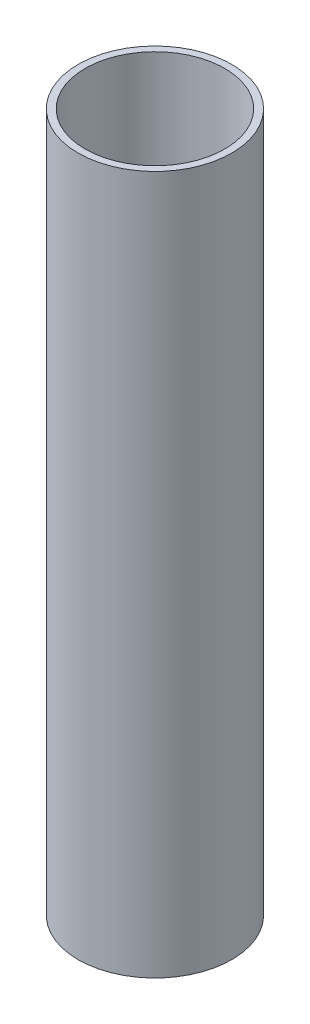
ISO-10303-21;
HEADER;
FILE_DESCRIPTION(('STEP AP214'),'2;1');
FILE_NAME('part.step','',(''),(''),'','','');
FILE_SCHEMA(('AUTOMOTIVE_DESIGN { 1 0 10303 214 1 1 1 1 }'));
ENDSEC;
DATA;
#1=APPLICATION_CONTEXT('core data for automotive mechanical design processes');
#2=APPLICATION_PROTOCOL_DEFINITION('international standard','automotive_design',2000,#1);
#3=PRODUCT_CONTEXT('',#1,'mechanical');
#4=PRODUCT('Part','Part','',(#3));
#5=PRODUCT_RELATED_PRODUCT_CATEGORY('part','',(#4));
#6=PRODUCT_DEFINITION_FORMATION('','',#4);
#7=PRODUCT_DEFINITION_CONTEXT('part definition',#1,'design');
#8=PRODUCT_DEFINITION('design','',#6,#7);
#9=PRODUCT_DEFINITION_SHAPE('','',#8);
#10=(LENGTH_UNIT() NAMED_UNIT(*) SI_UNIT(.MILLI.,.METRE.));
#11=(NAMED_UNIT(*) PLANE_ANGLE_UNIT() SI_UNIT($,.RADIAN.));
#12=(NAMED_UNIT(*) SI_UNIT($,.STERADIAN.) SOLID_ANGLE_UNIT());
#13=UNCERTAINTY_MEASURE_WITH_UNIT(LENGTH_MEASURE(1.E-05),#10,'distance_accuracy_value','');
#14=(GEOMETRIC_REPRESENTATION_CONTEXT(3) GLOBAL_UNCERTAINTY_ASSIGNED_CONTEXT((#13)) GLOBAL_UNIT_ASSIGNED_CONTEXT((#10,
#11,#12)) REPRESENTATION_CONTEXT('',''));
#15=CARTESIAN_POINT('',(0.,0.,0.));
#16=DIRECTION('',(0.,0.,1.));
#17=DIRECTION('',(1.,0.,0.));
#18=AXIS2_PLACEMENT_3D('',#15,#16,#17);
#19=CARTESIAN_POINT('',(0.,500.,0.));
#20=DIRECTION('',(0.,1.,0.));
#21=DIRECTION('',(0.,0.,1.));
#22=AXIS2_PLACEMENT_3D('',#19,#20,#21);
#23=PLANE('',#22);
#24=CARTESIAN_POINT('',(0.,500.,0.));
#25=DIRECTION('',(0.,1.,0.));
#26=DIRECTION('',(0.,0.,1.));
#27=AXIS2_PLACEMENT_3D('',#24,#25,#26);
#28=CIRCLE('',#27,55.);
#29=CARTESIAN_POINT('',(0.,500.,55.));
#30=VERTEX_POINT('',#29);
#31=EDGE_CURVE('E10',#30,#30,#28,.T.);
#32=ORIENTED_EDGE('',*,*,#31,.T.);
#33=EDGE_LOOP('',(#32));
#34=FACE_BOUND('',#33,.T.);
#35=CARTESIAN_POINT('',(0.,500.,0.));
#36=DIRECTION('',(0.,1.,0.));
#37=DIRECTION('',(0.,0.,1.));
#38=AXIS2_PLACEMENT_3D('',#35,#36,#37);
#39=CIRCLE('',#38,50.);
#40=CARTESIAN_POINT('',(0.,500.,50.));
#41=VERTEX_POINT('',#40);
#42=EDGE_CURVE('E26',#41,#41,#39,.T.);
#43=ORIENTED_EDGE('',*,*,#42,.F.);
#44=EDGE_LOOP('',(#43));
#45=FACE_BOUND('',#44,.T.);
#46=ADVANCED_FACE('F15',(#34,#45),#23,.T.);
#47=CARTESIAN_POINT('',(0.,0.,0.));
#48=DIRECTION('',(0.,1.,0.));
#49=DIRECTION('',(0.,0.,1.));
#50=AXIS2_PLACEMENT_3D('',#47,#48,#49);
#51=PLANE('',#50);
#52=CARTESIAN_POINT('',(0.,0.,0.));
#53=DIRECTION('',(0.,1.,0.));
#54=DIRECTION('',(0.,0.,1.));
#55=AXIS2_PLACEMENT_3D('',#52,#53,#54);
#56=CIRCLE('',#55,55.);
#57=CARTESIAN_POINT('',(0.,0.,55.));
#58=VERTEX_POINT('',#57);
#59=EDGE_CURVE('E19',#58,#58,#56,.T.);
#60=ORIENTED_EDGE('',*,*,#59,.F.);
#61=EDGE_LOOP('',(#60));
#62=FACE_BOUND('',#61,.T.);
#63=CARTESIAN_POINT('',(0.,0.,0.));
#64=DIRECTION('',(0.,1.,0.));
#65=DIRECTION('',(0.,0.,1.));
#66=AXIS2_PLACEMENT_3D('',#63,#64,#65);
#67=CIRCLE('',#66,50.);
#68=CARTESIAN_POINT('',(0.,0.,50.));
#69=VERTEX_POINT('',#68);
#70=EDGE_CURVE('E28',#69,#69,#67,.T.);
#71=ORIENTED_EDGE('',*,*,#70,.T.);
#72=EDGE_LOOP('',(#71));
#73=FACE_BOUND('',#72,.T.);
#74=ADVANCED_FACE('F38',(#62,#73),#51,.F.);
#75=CARTESIAN_POINT('',(0.,500.,0.));
#76=DIRECTION('',(0.,-1.,0.));
#77=DIRECTION('',(0.,0.,-1.));
#78=AXIS2_PLACEMENT_3D('',#75,#76,#77);
#79=CYLINDRICAL_SURFACE('',#78,55.);
#80=ORIENTED_EDGE('',*,*,#31,.F.);
#81=EDGE_LOOP('',(#80));
#82=FACE_BOUND('',#81,.T.);
#83=ORIENTED_EDGE('',*,*,#59,.T.);
#84=EDGE_LOOP('',(#83));
#85=FACE_BOUND('',#84,.T.);
#86=ADVANCED_FACE('F17',(#82,#85),#79,.T.);
#87=CARTESIAN_POINT('',(0.,500.,0.));
#88=DIRECTION('',(0.,-1.,0.));
#89=DIRECTION('',(0.,0.,-1.));
#90=AXIS2_PLACEMENT_3D('',#87,#88,#89);
#91=CYLINDRICAL_SURFACE('',#90,50.);
#92=ORIENTED_EDGE('',*,*,#42,.T.);
#93=EDGE_LOOP('',(#92));
#94=FACE_BOUND('',#93,.T.);
#95=ORIENTED_EDGE('',*,*,#70,.F.);
#96=EDGE_LOOP('',(#95));
#97=FACE_BOUND('',#96,.T.);
#98=ADVANCED_FACE('F34',(#94,#97),#91,.F.);
#99=CLOSED_SHELL('',(#46,#74,#86,#98));
#100=MANIFOLD_SOLID_BREP('B1',#99);
#101=ADVANCED_BREP_SHAPE_REPRESENTATION('',(#18,#100),#14);
#102=SHAPE_DEFINITION_REPRESENTATION(#9,#101);
ENDSEC;
END-ISO-10303-21;
